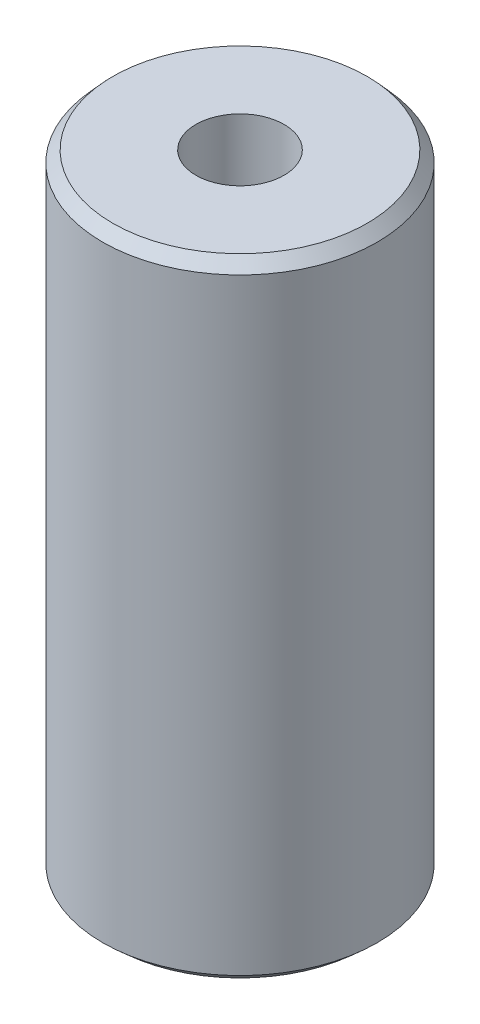
ISO-10303-21;
HEADER;
FILE_DESCRIPTION(('STEP AP214'),'2;1');
FILE_NAME('part.step','',(''),(''),'','','');
FILE_SCHEMA(('AUTOMOTIVE_DESIGN { 1 0 10303 214 1 1 1 1 }'));
ENDSEC;
DATA;
#1=APPLICATION_CONTEXT('core data for automotive mechanical design processes');
#2=APPLICATION_PROTOCOL_DEFINITION('international standard','automotive_design',2000,#1);
#3=PRODUCT_CONTEXT('',#1,'mechanical');
#4=PRODUCT('Part','Part','',(#3));
#5=PRODUCT_RELATED_PRODUCT_CATEGORY('part','',(#4));
#6=PRODUCT_DEFINITION_FORMATION('','',#4);
#7=PRODUCT_DEFINITION_CONTEXT('part definition',#1,'design');
#8=PRODUCT_DEFINITION('design','',#6,#7);
#9=PRODUCT_DEFINITION_SHAPE('','',#8);
#10=(LENGTH_UNIT() NAMED_UNIT(*) SI_UNIT(.MILLI.,.METRE.));
#11=(NAMED_UNIT(*) PLANE_ANGLE_UNIT() SI_UNIT($,.RADIAN.));
#12=(NAMED_UNIT(*) SI_UNIT($,.STERADIAN.) SOLID_ANGLE_UNIT());
#13=UNCERTAINTY_MEASURE_WITH_UNIT(LENGTH_MEASURE(1.E-05),#10,'distance_accuracy_value','');
#14=(GEOMETRIC_REPRESENTATION_CONTEXT(3) GLOBAL_UNCERTAINTY_ASSIGNED_CONTEXT((#13)) GLOBAL_UNIT_ASSIGNED_CONTEXT((#10,
#11,#12)) REPRESENTATION_CONTEXT('',''));
#15=CARTESIAN_POINT('',(0.,0.,0.));
#16=DIRECTION('',(0.,0.,1.));
#17=DIRECTION('',(1.,0.,0.));
#18=AXIS2_PLACEMENT_3D('',#15,#16,#17);
#19=CARTESIAN_POINT('',(0.,34.3034697803088,0.));
#20=DIRECTION('',(0.,-1.,0.));
#21=DIRECTION('',(0.,0.,-1.));
#22=AXIS2_PLACEMENT_3D('',#19,#20,#21);
#23=CYLINDRICAL_SURFACE('',#22,7.5);
#24=CARTESIAN_POINT('',(0.,33.6871114385725,0.));
#25=DIRECTION('',(0.,1.,0.));
#26=DIRECTION('',(0.,0.,1.));
#27=AXIS2_PLACEMENT_3D('',#24,#25,#26);
#28=CIRCLE('',#27,7.5);
#29=CARTESIAN_POINT('',(0.,33.6871114385725,7.5));
#30=VERTEX_POINT('',#29);
#31=EDGE_CURVE('E50',#30,#30,#28,.F.);
#32=ORIENTED_EDGE('',*,*,#31,.T.);
#33=EDGE_LOOP('',(#32));
#34=FACE_BOUND('',#33,.T.);
#35=CARTESIAN_POINT('',(0.,0.551504151212426,0.));
#36=DIRECTION('',(0.,1.,0.));
#37=DIRECTION('',(0.,0.,1.));
#38=AXIS2_PLACEMENT_3D('',#35,#36,#37);
#39=CIRCLE('',#38,7.5);
#40=CARTESIAN_POINT('',(0.,0.551504151212426,7.5));
#41=VERTEX_POINT('',#40);
#42=EDGE_CURVE('E51',#41,#41,#39,.T.);
#43=ORIENTED_EDGE('',*,*,#42,.T.);
#44=EDGE_LOOP('',(#43));
#45=FACE_BOUND('',#44,.T.);
#46=ADVANCED_FACE('F39',(#34,#45),#23,.T.);
#47=CARTESIAN_POINT('',(0.,34.3034697803088,0.));
#48=DIRECTION('',(0.,1.,0.));
#49=DIRECTION('',(0.,0.,1.));
#50=AXIS2_PLACEMENT_3D('',#47,#48,#49);
#51=PLANE('',#50);
#52=CARTESIAN_POINT('',(0.,34.3034697803088,0.));
#53=DIRECTION('',(0.,1.,0.));
#54=DIRECTION('',(0.,0.,1.));
#55=AXIS2_PLACEMENT_3D('',#52,#53,#54);
#56=CIRCLE('',#55,6.94849584878758);
#57=CARTESIAN_POINT('',(0.,34.3034697803088,6.94849584878758));
#58=VERTEX_POINT('',#57);
#59=EDGE_CURVE('E54',#58,#58,#56,.T.);
#60=ORIENTED_EDGE('',*,*,#59,.T.);
#61=EDGE_LOOP('',(#60));
#62=FACE_BOUND('',#61,.T.);
#63=CARTESIAN_POINT('',(0.,34.3034697803088,0.));
#64=DIRECTION('',(0.,1.,0.));
#65=DIRECTION('',(0.,0.,1.));
#66=AXIS2_PLACEMENT_3D('',#63,#64,#65);
#67=CIRCLE('',#66,2.40853980037843);
#68=CARTESIAN_POINT('',(0.,34.3034697803088,2.40853980037843));
#69=VERTEX_POINT('',#68);
#70=EDGE_CURVE('E58',#69,#69,#67,.T.);
#71=ORIENTED_EDGE('',*,*,#70,.F.);
#72=EDGE_LOOP('',(#71));
#73=FACE_BOUND('',#72,.T.);
#74=ADVANCED_FACE('F69',(#62,#73),#51,.T.);
#75=CARTESIAN_POINT('',(0.,0.,0.));
#76=DIRECTION('',(0.,1.,0.));
#77=DIRECTION('',(0.,0.,1.));
#78=AXIS2_PLACEMENT_3D('',#75,#76,#77);
#79=PLANE('',#78);
#80=CARTESIAN_POINT('',(0.,0.,0.));
#81=DIRECTION('',(0.,1.,0.));
#82=DIRECTION('',(0.,0.,1.));
#83=AXIS2_PLACEMENT_3D('',#80,#81,#82);
#84=CIRCLE('',#83,6.88364165826375);
#85=CARTESIAN_POINT('',(0.,0.,6.88364165826375));
#86=VERTEX_POINT('',#85);
#87=EDGE_CURVE('E10',#86,#86,#84,.F.);
#88=ORIENTED_EDGE('',*,*,#87,.T.);
#89=EDGE_LOOP('',(#88));
#90=FACE_BOUND('',#89,.T.);
#91=CARTESIAN_POINT('',(0.,0.,0.));
#92=DIRECTION('',(0.,1.,0.));
#93=DIRECTION('',(0.,0.,1.));
#94=AXIS2_PLACEMENT_3D('',#91,#92,#93);
#95=CIRCLE('',#94,2.40853980037843);
#96=CARTESIAN_POINT('',(0.,0.,2.40853980037843));
#97=VERTEX_POINT('',#96);
#98=EDGE_CURVE('E63',#97,#97,#95,.T.);
#99=ORIENTED_EDGE('',*,*,#98,.T.);
#100=EDGE_LOOP('',(#99));
#101=FACE_BOUND('',#100,.T.);
#102=ADVANCED_FACE('F75',(#90,#101),#79,.F.);
#103=CARTESIAN_POINT('',(0.,34.3034697803088,0.));
#104=DIRECTION('',(0.,-1.,0.));
#105=DIRECTION('',(0.,0.,-1.));
#106=AXIS2_PLACEMENT_3D('',#103,#104,#105);
#107=CYLINDRICAL_SURFACE('',#106,2.40853980037843);
#108=ORIENTED_EDGE('',*,*,#70,.T.);
#109=EDGE_LOOP('',(#108));
#110=FACE_BOUND('',#109,.T.);
#111=ORIENTED_EDGE('',*,*,#98,.F.);
#112=EDGE_LOOP('',(#111));
#113=FACE_BOUND('',#112,.T.);
#114=ADVANCED_FACE('F70',(#110,#113),#107,.F.);
#115=CARTESIAN_POINT('',(0.,34.3034697803088,0.));
#116=DIRECTION('',(0.,-1.,0.));
#117=DIRECTION('',(0.,0.,-1.));
#118=AXIS2_PLACEMENT_3D('',#115,#116,#117);
#119=CONICAL_SURFACE('',#118,6.94849584878758,0.729922756641917);
#120=ORIENTED_EDGE('',*,*,#31,.F.);
#121=EDGE_LOOP('',(#120));
#122=FACE_BOUND('',#121,.T.);
#123=ORIENTED_EDGE('',*,*,#59,.F.);
#124=EDGE_LOOP('',(#123));
#125=FACE_BOUND('',#124,.T.);
#126=ADVANCED_FACE('F81',(#122,#125),#119,.T.);
#127=CARTESIAN_POINT('',(0.,0.551504151212426,0.));
#128=DIRECTION('',(0.,1.,0.));
#129=DIRECTION('',(0.,0.,1.));
#130=AXIS2_PLACEMENT_3D('',#127,#128,#129);
#131=CONICAL_SURFACE('',#130,7.5,0.840873570152986);
#132=ORIENTED_EDGE('',*,*,#87,.F.);
#133=EDGE_LOOP('',(#132));
#134=FACE_BOUND('',#133,.T.);
#135=ORIENTED_EDGE('',*,*,#42,.F.);
#136=EDGE_LOOP('',(#135));
#137=FACE_BOUND('',#136,.T.);
#138=ADVANCED_FACE('F45',(#134,#137),#131,.T.);
#139=CLOSED_SHELL('',(#46,#74,#102,#114,#126,#138));
#140=MANIFOLD_SOLID_BREP('B2',#139);
#141=ADVANCED_BREP_SHAPE_REPRESENTATION('',(#18,#140),#14);
#142=SHAPE_DEFINITION_REPRESENTATION(#9,#141);
ENDSEC;
END-ISO-10303-21;
